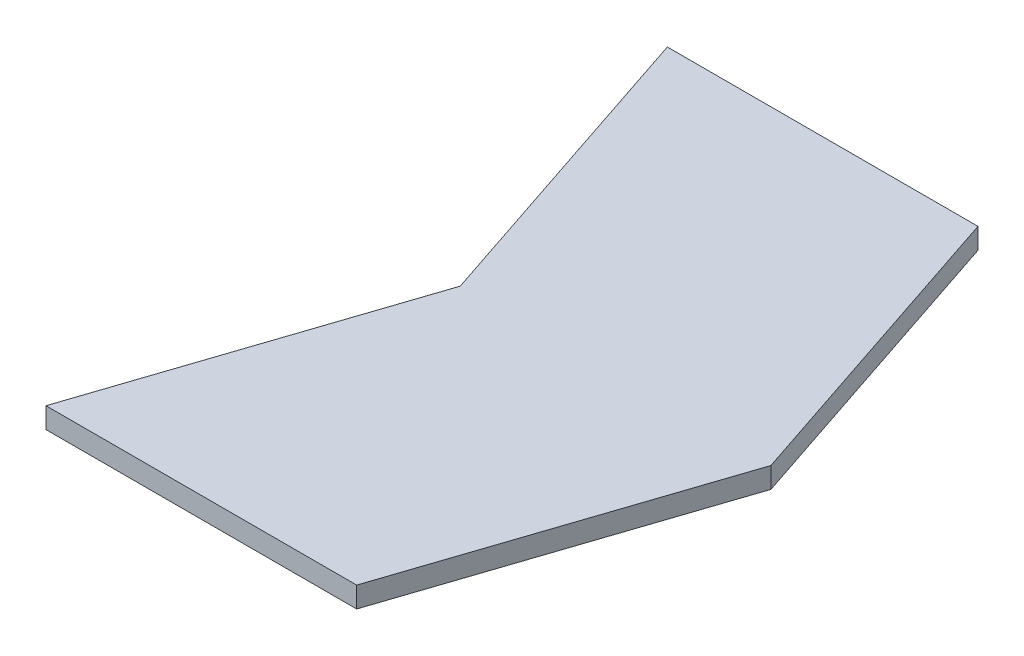
ISO-10303-21;
HEADER;
FILE_DESCRIPTION(('STEP AP214'),'2;1');
FILE_NAME('part.step','',(''),(''),'','','');
FILE_SCHEMA(('AUTOMOTIVE_DESIGN { 1 0 10303 214 1 1 1 1 }'));
ENDSEC;
DATA;
#1=APPLICATION_CONTEXT('core data for automotive mechanical design processes');
#2=APPLICATION_PROTOCOL_DEFINITION('international standard','automotive_design',2000,#1);
#3=PRODUCT_CONTEXT('',#1,'mechanical');
#4=PRODUCT('Part','Part','',(#3));
#5=PRODUCT_RELATED_PRODUCT_CATEGORY('part','',(#4));
#6=PRODUCT_DEFINITION_FORMATION('','',#4);
#7=PRODUCT_DEFINITION_CONTEXT('part definition',#1,'design');
#8=PRODUCT_DEFINITION('design','',#6,#7);
#9=PRODUCT_DEFINITION_SHAPE('','',#8);
#10=(LENGTH_UNIT() NAMED_UNIT(*) SI_UNIT(.MILLI.,.METRE.));
#11=(NAMED_UNIT(*) PLANE_ANGLE_UNIT() SI_UNIT($,.RADIAN.));
#12=(NAMED_UNIT(*) SI_UNIT($,.STERADIAN.) SOLID_ANGLE_UNIT());
#13=UNCERTAINTY_MEASURE_WITH_UNIT(LENGTH_MEASURE(1.E-05),#10,'distance_accuracy_value','');
#14=(GEOMETRIC_REPRESENTATION_CONTEXT(3) GLOBAL_UNCERTAINTY_ASSIGNED_CONTEXT((#13)) GLOBAL_UNIT_ASSIGNED_CONTEXT((#10,
#11,#12)) REPRESENTATION_CONTEXT('',''));
#15=CARTESIAN_POINT('',(0.,0.,0.));
#16=DIRECTION('',(0.,0.,1.));
#17=DIRECTION('',(1.,0.,0.));
#18=AXIS2_PLACEMENT_3D('',#15,#16,#17);
#19=CARTESIAN_POINT('',(6.35,1.27,-19.05));
#20=DIRECTION('',(0.948683298050514,0.,0.316227766016838));
#21=DIRECTION('',(0.316227766016838,0.,-0.948683298050514));
#22=AXIS2_PLACEMENT_3D('',#19,#20,#21);
#23=PLANE('',#22);
#24=DIRECTION('',(-0.316227766016838,0.,0.948683298050514));
#25=VECTOR('',#24,1.);
#26=CARTESIAN_POINT('',(6.35,0.,-19.05));
#27=LINE('',#26,#25);
#28=CARTESIAN_POINT('',(6.35,0.,-19.05));
#29=VERTEX_POINT('',#28);
#30=CARTESIAN_POINT('',(0.,0.,0.));
#31=VERTEX_POINT('',#30);
#32=EDGE_CURVE('E131',#29,#31,#27,.T.);
#33=ORIENTED_EDGE('',*,*,#32,.T.);
#34=DIRECTION('',(0.,-1.,0.));
#35=VECTOR('',#34,1.);
#36=CARTESIAN_POINT('',(0.,1.27,0.));
#37=LINE('',#36,#35);
#38=CARTESIAN_POINT('',(0.,1.27,0.));
#39=VERTEX_POINT('',#38);
#40=EDGE_CURVE('E11',#39,#31,#37,.T.);
#41=ORIENTED_EDGE('',*,*,#40,.F.);
#42=DIRECTION('',(-0.316227766016838,0.,0.948683298050514));
#43=VECTOR('',#42,1.);
#44=CARTESIAN_POINT('',(6.35,1.27,-19.05));
#45=LINE('',#44,#43);
#46=CARTESIAN_POINT('',(6.35,1.27,-19.05));
#47=VERTEX_POINT('',#46);
#48=EDGE_CURVE('E147',#47,#39,#45,.T.);
#49=ORIENTED_EDGE('',*,*,#48,.F.);
#50=DIRECTION('',(0.,-1.,0.));
#51=VECTOR('',#50,1.);
#52=CARTESIAN_POINT('',(6.35,1.27,-19.05));
#53=LINE('',#52,#51);
#54=EDGE_CURVE('E127',#47,#29,#53,.T.);
#55=ORIENTED_EDGE('',*,*,#54,.T.);
#56=EDGE_LOOP('',(#33,#41,#49,#55));
#57=FACE_BOUND('',#56,.T.);
#58=ADVANCED_FACE('F42',(#57),#23,.F.);
#59=CARTESIAN_POINT('',(0.,1.27,0.));
#60=DIRECTION('',(0.,0.,-1.));
#61=DIRECTION('',(-1.,0.,0.));
#62=AXIS2_PLACEMENT_3D('',#59,#60,#61);
#63=PLANE('',#62);
#64=DIRECTION('',(1.,0.,0.));
#65=VECTOR('',#64,1.);
#66=CARTESIAN_POINT('',(0.,0.,0.));
#67=LINE('',#66,#65);
#68=CARTESIAN_POINT('',(19.05,0.,0.));
#69=VERTEX_POINT('',#68);
#70=EDGE_CURVE('E135',#31,#69,#67,.T.);
#71=ORIENTED_EDGE('',*,*,#70,.T.);
#72=DIRECTION('',(0.,-1.,0.));
#73=VECTOR('',#72,1.);
#74=CARTESIAN_POINT('',(19.05,1.27,0.));
#75=LINE('',#74,#73);
#76=CARTESIAN_POINT('',(19.05,1.27,0.));
#77=VERTEX_POINT('',#76);
#78=EDGE_CURVE('E51',#77,#69,#75,.T.);
#79=ORIENTED_EDGE('',*,*,#78,.F.);
#80=DIRECTION('',(1.,0.,0.));
#81=VECTOR('',#80,1.);
#82=CARTESIAN_POINT('',(0.,1.27,0.));
#83=LINE('',#82,#81);
#84=EDGE_CURVE('E96',#39,#77,#83,.T.);
#85=ORIENTED_EDGE('',*,*,#84,.F.);
#86=ORIENTED_EDGE('',*,*,#40,.T.);
#87=EDGE_LOOP('',(#71,#79,#85,#86));
#88=FACE_BOUND('',#87,.T.);
#89=ADVANCED_FACE('F175',(#88),#63,.F.);
#90=CARTESIAN_POINT('',(19.05,1.27,0.));
#91=DIRECTION('',(-0.948683298050514,0.,-0.316227766016838));
#92=DIRECTION('',(-0.316227766016838,0.,0.948683298050514));
#93=AXIS2_PLACEMENT_3D('',#90,#91,#92);
#94=PLANE('',#93);
#95=DIRECTION('',(0.316227766016838,0.,-0.948683298050514));
#96=VECTOR('',#95,1.);
#97=CARTESIAN_POINT('',(19.05,0.,0.));
#98=LINE('',#97,#96);
#99=CARTESIAN_POINT('',(25.4,0.,-19.05));
#100=VERTEX_POINT('',#99);
#101=EDGE_CURVE('E138',#69,#100,#98,.T.);
#102=ORIENTED_EDGE('',*,*,#101,.T.);
#103=DIRECTION('',(0.,-1.,0.));
#104=VECTOR('',#103,1.);
#105=CARTESIAN_POINT('',(25.4,1.27,-19.05));
#106=LINE('',#105,#104);
#107=CARTESIAN_POINT('',(25.4,1.27,-19.05));
#108=VERTEX_POINT('',#107);
#109=EDGE_CURVE('E120',#108,#100,#106,.T.);
#110=ORIENTED_EDGE('',*,*,#109,.F.);
#111=DIRECTION('',(0.316227766016838,0.,-0.948683298050514));
#112=VECTOR('',#111,1.);
#113=CARTESIAN_POINT('',(19.05,1.27,0.));
#114=LINE('',#113,#112);
#115=EDGE_CURVE('E109',#77,#108,#114,.T.);
#116=ORIENTED_EDGE('',*,*,#115,.F.);
#117=ORIENTED_EDGE('',*,*,#78,.T.);
#118=EDGE_LOOP('',(#102,#110,#116,#117));
#119=FACE_BOUND('',#118,.T.);
#120=ADVANCED_FACE('F157',(#119),#94,.F.);
#121=CARTESIAN_POINT('',(25.4,1.27,-19.05));
#122=DIRECTION('',(-0.948683298050514,0.,0.316227766016838));
#123=DIRECTION('',(0.316227766016838,0.,0.948683298050514));
#124=AXIS2_PLACEMENT_3D('',#121,#122,#123);
#125=PLANE('',#124);
#126=DIRECTION('',(-0.316227766016838,0.,-0.948683298050514));
#127=VECTOR('',#126,1.);
#128=CARTESIAN_POINT('',(25.4,0.,-19.05));
#129=LINE('',#128,#127);
#130=CARTESIAN_POINT('',(19.05,0.,-38.1));
#131=VERTEX_POINT('',#130);
#132=EDGE_CURVE('E118',#100,#131,#129,.T.);
#133=ORIENTED_EDGE('',*,*,#132,.T.);
#134=DIRECTION('',(0.,-1.,0.));
#135=VECTOR('',#134,1.);
#136=CARTESIAN_POINT('',(19.05,1.27,-38.1));
#137=LINE('',#136,#135);
#138=CARTESIAN_POINT('',(19.05,1.27,-38.1));
#139=VERTEX_POINT('',#138);
#140=EDGE_CURVE('E115',#139,#131,#137,.T.);
#141=ORIENTED_EDGE('',*,*,#140,.F.);
#142=DIRECTION('',(-0.316227766016838,0.,-0.948683298050514));
#143=VECTOR('',#142,1.);
#144=CARTESIAN_POINT('',(25.4,1.27,-19.05));
#145=LINE('',#144,#143);
#146=EDGE_CURVE('E103',#108,#139,#145,.T.);
#147=ORIENTED_EDGE('',*,*,#146,.F.);
#148=ORIENTED_EDGE('',*,*,#109,.T.);
#149=EDGE_LOOP('',(#133,#141,#147,#148));
#150=FACE_BOUND('',#149,.T.);
#151=ADVANCED_FACE('F116',(#150),#125,.F.);
#152=CARTESIAN_POINT('',(19.05,1.27,-38.1));
#153=DIRECTION('',(0.,0.,1.));
#154=DIRECTION('',(1.,0.,0.));
#155=AXIS2_PLACEMENT_3D('',#152,#153,#154);
#156=PLANE('',#155);
#157=DIRECTION('',(-1.,0.,0.));
#158=VECTOR('',#157,1.);
#159=CARTESIAN_POINT('',(19.05,0.,-38.1));
#160=LINE('',#159,#158);
#161=CARTESIAN_POINT('',(0.,0.,-38.1));
#162=VERTEX_POINT('',#161);
#163=EDGE_CURVE('E82',#131,#162,#160,.T.);
#164=ORIENTED_EDGE('',*,*,#163,.T.);
#165=DIRECTION('',(0.,-1.,0.));
#166=VECTOR('',#165,1.);
#167=CARTESIAN_POINT('',(0.,1.27,-38.1));
#168=LINE('',#167,#166);
#169=CARTESIAN_POINT('',(0.,1.27,-38.1));
#170=VERTEX_POINT('',#169);
#171=EDGE_CURVE('E121',#170,#162,#168,.T.);
#172=ORIENTED_EDGE('',*,*,#171,.F.);
#173=DIRECTION('',(-1.,0.,0.));
#174=VECTOR('',#173,1.);
#175=CARTESIAN_POINT('',(19.05,1.27,-38.1));
#176=LINE('',#175,#174);
#177=EDGE_CURVE('E107',#139,#170,#176,.T.);
#178=ORIENTED_EDGE('',*,*,#177,.F.);
#179=ORIENTED_EDGE('',*,*,#140,.T.);
#180=EDGE_LOOP('',(#164,#172,#178,#179));
#181=FACE_BOUND('',#180,.T.);
#182=ADVANCED_FACE('F123',(#181),#156,.F.);
#183=CARTESIAN_POINT('',(0.,1.27,-38.1));
#184=DIRECTION('',(0.948683298050514,0.,-0.316227766016838));
#185=DIRECTION('',(-0.316227766016838,0.,-0.948683298050514));
#186=AXIS2_PLACEMENT_3D('',#183,#184,#185);
#187=PLANE('',#186);
#188=DIRECTION('',(0.316227766016838,0.,0.948683298050514));
#189=VECTOR('',#188,1.);
#190=CARTESIAN_POINT('',(0.,0.,-38.1));
#191=LINE('',#190,#189);
#192=EDGE_CURVE('E88',#162,#29,#191,.T.);
#193=ORIENTED_EDGE('',*,*,#192,.T.);
#194=ORIENTED_EDGE('',*,*,#54,.F.);
#195=DIRECTION('',(0.316227766016838,0.,0.948683298050514));
#196=VECTOR('',#195,1.);
#197=CARTESIAN_POINT('',(0.,1.27,-38.1));
#198=LINE('',#197,#196);
#199=EDGE_CURVE('E59',#170,#47,#198,.T.);
#200=ORIENTED_EDGE('',*,*,#199,.F.);
#201=ORIENTED_EDGE('',*,*,#171,.T.);
#202=EDGE_LOOP('',(#193,#194,#200,#201));
#203=FACE_BOUND('',#202,.T.);
#204=ADVANCED_FACE('F164',(#203),#187,.F.);
#205=CARTESIAN_POINT('',(0.,1.27,0.));
#206=DIRECTION('',(0.,1.,0.));
#207=DIRECTION('',(0.,0.,1.));
#208=AXIS2_PLACEMENT_3D('',#205,#206,#207);
#209=PLANE('',#208);
#210=ORIENTED_EDGE('',*,*,#48,.T.);
#211=ORIENTED_EDGE('',*,*,#84,.T.);
#212=ORIENTED_EDGE('',*,*,#115,.T.);
#213=ORIENTED_EDGE('',*,*,#146,.T.);
#214=ORIENTED_EDGE('',*,*,#177,.T.);
#215=ORIENTED_EDGE('',*,*,#199,.T.);
#216=EDGE_LOOP('',(#210,#211,#212,#213,#214,#215));
#217=FACE_BOUND('',#216,.T.);
#218=ADVANCED_FACE('F105',(#217),#209,.T.);
#219=CARTESIAN_POINT('',(0.,0.,0.));
#220=DIRECTION('',(0.,1.,0.));
#221=DIRECTION('',(0.,0.,1.));
#222=AXIS2_PLACEMENT_3D('',#219,#220,#221);
#223=PLANE('',#222);
#224=ORIENTED_EDGE('',*,*,#32,.F.);
#225=ORIENTED_EDGE('',*,*,#192,.F.);
#226=ORIENTED_EDGE('',*,*,#163,.F.);
#227=ORIENTED_EDGE('',*,*,#132,.F.);
#228=ORIENTED_EDGE('',*,*,#101,.F.);
#229=ORIENTED_EDGE('',*,*,#70,.F.);
#230=EDGE_LOOP('',(#224,#225,#226,#227,#228,#229));
#231=FACE_BOUND('',#230,.T.);
#232=ADVANCED_FACE('F160',(#231),#223,.F.);
#233=CLOSED_SHELL('',(#58,#89,#120,#151,#182,#204,#218,#232));
#234=MANIFOLD_SOLID_BREP('B2',#233);
#235=ADVANCED_BREP_SHAPE_REPRESENTATION('',(#18,#234),#14);
#236=SHAPE_DEFINITION_REPRESENTATION(#9,#235);
ENDSEC;
END-ISO-10303-21;
